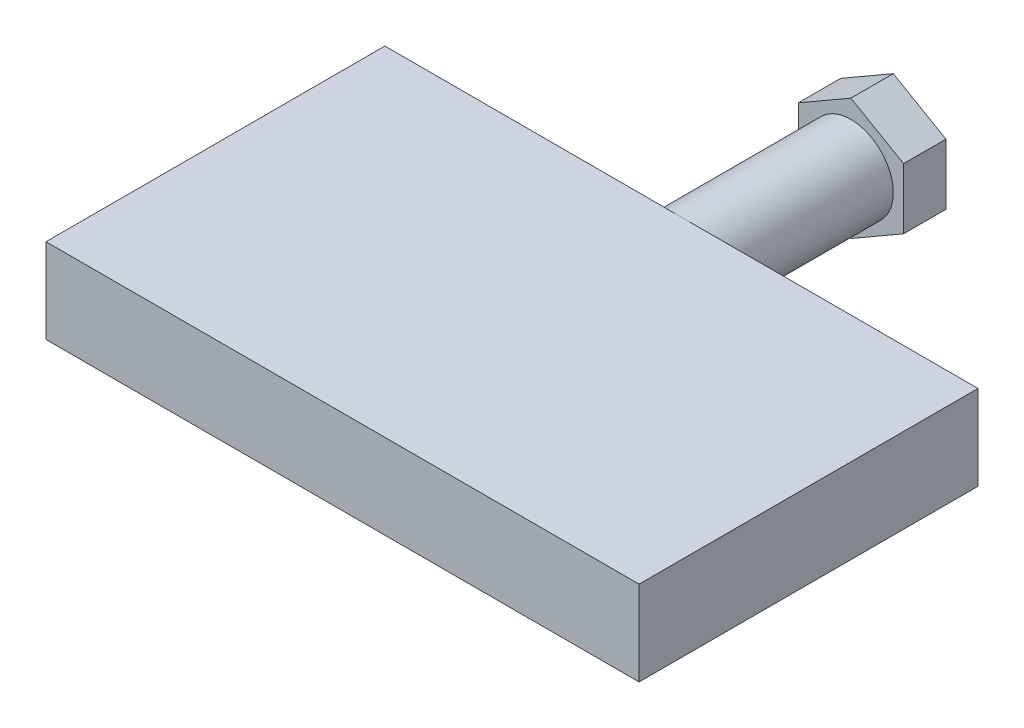
ISO-10303-21;
HEADER;
FILE_DESCRIPTION(('STEP AP214'),'2;1');
FILE_NAME('part.step','',(''),(''),'','','');
FILE_SCHEMA(('AUTOMOTIVE_DESIGN { 1 0 10303 214 1 1 1 1 }'));
ENDSEC;
DATA;
#1=APPLICATION_CONTEXT('core data for automotive mechanical design processes');
#2=APPLICATION_PROTOCOL_DEFINITION('international standard','automotive_design',2000,#1);
#3=PRODUCT_CONTEXT('',#1,'mechanical');
#4=PRODUCT('Part','Part','',(#3));
#5=PRODUCT_RELATED_PRODUCT_CATEGORY('part','',(#4));
#6=PRODUCT_DEFINITION_FORMATION('','',#4);
#7=PRODUCT_DEFINITION_CONTEXT('part definition',#1,'design');
#8=PRODUCT_DEFINITION('design','',#6,#7);
#9=PRODUCT_DEFINITION_SHAPE('','',#8);
#10=(LENGTH_UNIT() NAMED_UNIT(*) SI_UNIT(.MILLI.,.METRE.));
#11=(NAMED_UNIT(*) PLANE_ANGLE_UNIT() SI_UNIT($,.RADIAN.));
#12=(NAMED_UNIT(*) SI_UNIT($,.STERADIAN.) SOLID_ANGLE_UNIT());
#13=UNCERTAINTY_MEASURE_WITH_UNIT(LENGTH_MEASURE(1.E-05),#10,'distance_accuracy_value','');
#14=(GEOMETRIC_REPRESENTATION_CONTEXT(3) GLOBAL_UNCERTAINTY_ASSIGNED_CONTEXT((#13)) GLOBAL_UNIT_ASSIGNED_CONTEXT((#10,
#11,#12)) REPRESENTATION_CONTEXT('',''));
#15=CARTESIAN_POINT('',(0.,0.,0.));
#16=DIRECTION('',(0.,0.,1.));
#17=DIRECTION('',(1.,0.,0.));
#18=AXIS2_PLACEMENT_3D('',#15,#16,#17);
#19=CARTESIAN_POINT('',(0.,10.,-40.657635654133));
#20=DIRECTION('',(0.,0.,-1.));
#21=DIRECTION('',(-1.,0.,0.));
#22=AXIS2_PLACEMENT_3D('',#19,#20,#21);
#23=PLANE('',#22);
#24=CARTESIAN_POINT('',(0.,5.,-40.657635654133));
#25=DIRECTION('',(0.,0.,-1.));
#26=DIRECTION('',(-1.,0.,0.));
#27=AXIS2_PLACEMENT_3D('',#24,#25,#26);
#28=CIRCLE('',#27,5.);
#29=CARTESIAN_POINT('',(0.,10.,-40.657635654133));
#30=VERTEX_POINT('',#29);
#31=CARTESIAN_POINT('',(0.,0.,-40.657635654133));
#32=VERTEX_POINT('',#31);
#33=EDGE_CURVE('E50',#30,#32,#28,.T.);
#34=ORIENTED_EDGE('',*,*,#33,.F.);
#35=DIRECTION('',(1.,0.,0.));
#36=VECTOR('',#35,1.);
#37=CARTESIAN_POINT('',(0.,10.,-40.657635654133));
#38=LINE('',#37,#36);
#39=CARTESIAN_POINT('',(35.,10.,-40.657635654133));
#40=VERTEX_POINT('',#39);
#41=EDGE_CURVE('E64',#30,#40,#38,.T.);
#42=ORIENTED_EDGE('',*,*,#41,.T.);
#43=DIRECTION('',(0.,-1.,0.));
#44=VECTOR('',#43,1.);
#45=CARTESIAN_POINT('',(35.,10.,-40.657635654133));
#46=LINE('',#45,#44);
#47=CARTESIAN_POINT('',(35.,0.,-40.657635654133));
#48=VERTEX_POINT('',#47);
#49=EDGE_CURVE('E186',#40,#48,#46,.T.);
#50=ORIENTED_EDGE('',*,*,#49,.T.);
#51=DIRECTION('',(1.,0.,0.));
#52=VECTOR('',#51,1.);
#53=CARTESIAN_POINT('',(0.,0.,-40.657635654133));
#54=LINE('',#53,#52);
#55=EDGE_CURVE('E86',#32,#48,#54,.T.);
#56=ORIENTED_EDGE('',*,*,#55,.F.);
#57=EDGE_LOOP('',(#34,#42,#50,#56));
#58=FACE_BOUND('',#57,.T.);
#59=ADVANCED_FACE('F39',(#58),#23,.T.);
#60=EDGE_CURVE('E11',#32,#30,#28,.T.);
#61=ORIENTED_EDGE('',*,*,#60,.F.);
#62=CARTESIAN_POINT('',(-35.,0.,-40.657635654133));
#63=VERTEX_POINT('',#62);
#64=EDGE_CURVE('E187',#63,#32,#54,.T.);
#65=ORIENTED_EDGE('',*,*,#64,.F.);
#66=DIRECTION('',(0.,-1.,0.));
#67=VECTOR('',#66,1.);
#68=CARTESIAN_POINT('',(-35.,10.,-40.657635654133));
#69=LINE('',#68,#67);
#70=CARTESIAN_POINT('',(-35.,10.,-40.657635654133));
#71=VERTEX_POINT('',#70);
#72=EDGE_CURVE('E43',#71,#63,#69,.T.);
#73=ORIENTED_EDGE('',*,*,#72,.F.);
#74=EDGE_CURVE('E171',#71,#30,#38,.T.);
#75=ORIENTED_EDGE('',*,*,#74,.T.);
#76=EDGE_LOOP('',(#61,#65,#73,#75));
#77=FACE_BOUND('',#76,.T.);
#78=ADVANCED_FACE('F41',(#77),#23,.T.);
#79=CARTESIAN_POINT('',(-35.,10.,0.));
#80=DIRECTION('',(-1.,0.,0.));
#81=DIRECTION('',(0.,0.,1.));
#82=AXIS2_PLACEMENT_3D('',#79,#80,#81);
#83=PLANE('',#82);
#84=DIRECTION('',(0.,0.,-1.));
#85=VECTOR('',#84,1.);
#86=CARTESIAN_POINT('',(-35.,0.,0.));
#87=LINE('',#86,#85);
#88=CARTESIAN_POINT('',(-35.,0.,-0.657635654132944));
#89=VERTEX_POINT('',#88);
#90=EDGE_CURVE('E190',#89,#63,#87,.T.);
#91=ORIENTED_EDGE('',*,*,#90,.F.);
#92=DIRECTION('',(0.,-1.,0.));
#93=VECTOR('',#92,1.);
#94=CARTESIAN_POINT('',(-35.,10.,-0.657635654132944));
#95=LINE('',#94,#93);
#96=CARTESIAN_POINT('',(-35.,10.,-0.657635654132944));
#97=VERTEX_POINT('',#96);
#98=EDGE_CURVE('E205',#97,#89,#95,.T.);
#99=ORIENTED_EDGE('',*,*,#98,.F.);
#100=DIRECTION('',(0.,0.,-1.));
#101=VECTOR('',#100,1.);
#102=CARTESIAN_POINT('',(-35.,10.,0.));
#103=LINE('',#102,#101);
#104=EDGE_CURVE('E174',#97,#71,#103,.T.);
#105=ORIENTED_EDGE('',*,*,#104,.T.);
#106=ORIENTED_EDGE('',*,*,#72,.T.);
#107=EDGE_LOOP('',(#91,#99,#105,#106));
#108=FACE_BOUND('',#107,.T.);
#109=ADVANCED_FACE('F212',(#108),#83,.T.);
#110=CARTESIAN_POINT('',(0.,10.,-0.657635654132948));
#111=DIRECTION('',(0.,0.,1.));
#112=DIRECTION('',(1.,0.,0.));
#113=AXIS2_PLACEMENT_3D('',#110,#111,#112);
#114=PLANE('',#113);
#115=DIRECTION('',(-1.,0.,0.));
#116=VECTOR('',#115,1.);
#117=CARTESIAN_POINT('',(0.,0.,-0.657635654132948));
#118=LINE('',#117,#116);
#119=CARTESIAN_POINT('',(35.,0.,-0.657635654132953));
#120=VERTEX_POINT('',#119);
#121=EDGE_CURVE('E194',#120,#89,#118,.T.);
#122=ORIENTED_EDGE('',*,*,#121,.F.);
#123=DIRECTION('',(0.,-1.,0.));
#124=VECTOR('',#123,1.);
#125=CARTESIAN_POINT('',(35.,10.,-0.657635654132953));
#126=LINE('',#125,#124);
#127=CARTESIAN_POINT('',(35.,10.,-0.657635654132953));
#128=VERTEX_POINT('',#127);
#129=EDGE_CURVE('E203',#128,#120,#126,.T.);
#130=ORIENTED_EDGE('',*,*,#129,.F.);
#131=DIRECTION('',(-1.,0.,0.));
#132=VECTOR('',#131,1.);
#133=CARTESIAN_POINT('',(0.,10.,-0.657635654132948));
#134=LINE('',#133,#132);
#135=EDGE_CURVE('E178',#128,#97,#134,.T.);
#136=ORIENTED_EDGE('',*,*,#135,.T.);
#137=ORIENTED_EDGE('',*,*,#98,.T.);
#138=EDGE_LOOP('',(#122,#130,#136,#137));
#139=FACE_BOUND('',#138,.T.);
#140=ADVANCED_FACE('F216',(#139),#114,.T.);
#141=CARTESIAN_POINT('',(35.,10.,0.));
#142=DIRECTION('',(1.,0.,0.));
#143=DIRECTION('',(0.,0.,-1.));
#144=AXIS2_PLACEMENT_3D('',#141,#142,#143);
#145=PLANE('',#144);
#146=DIRECTION('',(0.,0.,1.));
#147=VECTOR('',#146,1.);
#148=CARTESIAN_POINT('',(35.,0.,0.));
#149=LINE('',#148,#147);
#150=EDGE_CURVE('E198',#48,#120,#149,.T.);
#151=ORIENTED_EDGE('',*,*,#150,.F.);
#152=ORIENTED_EDGE('',*,*,#49,.F.);
#153=DIRECTION('',(0.,0.,1.));
#154=VECTOR('',#153,1.);
#155=CARTESIAN_POINT('',(35.,10.,0.));
#156=LINE('',#155,#154);
#157=EDGE_CURVE('E182',#40,#128,#156,.T.);
#158=ORIENTED_EDGE('',*,*,#157,.T.);
#159=ORIENTED_EDGE('',*,*,#129,.T.);
#160=EDGE_LOOP('',(#151,#152,#158,#159));
#161=FACE_BOUND('',#160,.T.);
#162=ADVANCED_FACE('F222',(#161),#145,.T.);
#163=CARTESIAN_POINT('',(0.,10.,0.));
#164=DIRECTION('',(0.,1.,0.));
#165=DIRECTION('',(0.,0.,1.));
#166=AXIS2_PLACEMENT_3D('',#163,#164,#165);
#167=PLANE('',#166);
#168=ORIENTED_EDGE('',*,*,#74,.F.);
#169=ORIENTED_EDGE('',*,*,#104,.F.);
#170=ORIENTED_EDGE('',*,*,#135,.F.);
#171=ORIENTED_EDGE('',*,*,#157,.F.);
#172=ORIENTED_EDGE('',*,*,#41,.F.);
#173=EDGE_LOOP('',(#168,#169,#170,#171,#172));
#174=FACE_BOUND('',#173,.T.);
#175=ADVANCED_FACE('F221',(#174),#167,.T.);
#176=CARTESIAN_POINT('',(0.,0.,0.));
#177=DIRECTION('',(0.,1.,0.));
#178=DIRECTION('',(0.,0.,1.));
#179=AXIS2_PLACEMENT_3D('',#176,#177,#178);
#180=PLANE('',#179);
#181=ORIENTED_EDGE('',*,*,#64,.T.);
#182=ORIENTED_EDGE('',*,*,#55,.T.);
#183=ORIENTED_EDGE('',*,*,#150,.T.);
#184=ORIENTED_EDGE('',*,*,#121,.T.);
#185=ORIENTED_EDGE('',*,*,#90,.T.);
#186=EDGE_LOOP('',(#181,#182,#183,#184,#185));
#187=FACE_BOUND('',#186,.T.);
#188=ADVANCED_FACE('F214',(#187),#180,.F.);
#189=CARTESIAN_POINT('',(0.,5.,-60.657635654133));
#190=DIRECTION('',(0.,0.,1.));
#191=DIRECTION('',(1.,0.,0.));
#192=AXIS2_PLACEMENT_3D('',#189,#190,#191);
#193=CYLINDRICAL_SURFACE('',#192,5.);
#194=CARTESIAN_POINT('',(0.,5.,-60.657635654133));
#195=DIRECTION('',(0.,0.,-1.));
#196=DIRECTION('',(-1.,0.,0.));
#197=AXIS2_PLACEMENT_3D('',#194,#195,#196);
#198=CIRCLE('',#197,5.);
#199=CARTESIAN_POINT('',(-5.,5.,-60.657635654133));
#200=VERTEX_POINT('',#199);
#201=EDGE_CURVE('E163',#200,#200,#198,.T.);
#202=ORIENTED_EDGE('',*,*,#201,.F.);
#203=EDGE_LOOP('',(#202));
#204=FACE_BOUND('',#203,.T.);
#205=ORIENTED_EDGE('',*,*,#33,.T.);
#206=ORIENTED_EDGE('',*,*,#60,.T.);
#207=EDGE_LOOP('',(#205,#206));
#208=FACE_BOUND('',#207,.T.);
#209=ADVANCED_FACE('F226',(#204,#208),#193,.T.);
#210=CARTESIAN_POINT('',(6.21470170513772,1.41194029760541,-65.657635654133));
#211=DIRECTION('',(-0.499999999999995,0.866025403784442,0.));
#212=DIRECTION('',(-0.866025403784442,-0.499999999999995,0.));
#213=AXIS2_PLACEMENT_3D('',#210,#211,#212);
#214=PLANE('',#213);
#215=DIRECTION('',(-0.866025403784442,-0.499999999999995,0.));
#216=VECTOR('',#215,1.);
#217=CARTESIAN_POINT('',(6.21470170513772,1.41194029760541,-60.657635654133));
#218=LINE('',#217,#216);
#219=CARTESIAN_POINT('',(6.21470170513772,1.41194029760541,-60.657635654133));
#220=VERTEX_POINT('',#219);
#221=CARTESIAN_POINT('',(0.,-2.17611940478903,-60.657635654133));
#222=VERTEX_POINT('',#221);
#223=EDGE_CURVE('E157',#220,#222,#218,.T.);
#224=ORIENTED_EDGE('',*,*,#223,.T.);
#225=DIRECTION('',(0.,0.,1.));
#226=VECTOR('',#225,1.);
#227=CARTESIAN_POINT('',(0.,-2.17611940478903,-65.657635654133));
#228=LINE('',#227,#226);
#229=CARTESIAN_POINT('',(0.,-2.17611940478903,-65.657635654133));
#230=VERTEX_POINT('',#229);
#231=EDGE_CURVE('E135',#230,#222,#228,.T.);
#232=ORIENTED_EDGE('',*,*,#231,.F.);
#233=DIRECTION('',(-0.866025403784442,-0.499999999999995,0.));
#234=VECTOR('',#233,1.);
#235=CARTESIAN_POINT('',(6.21470170513772,1.41194029760541,-65.657635654133));
#236=LINE('',#235,#234);
#237=CARTESIAN_POINT('',(6.21470170513772,1.41194029760541,-65.657635654133));
#238=VERTEX_POINT('',#237);
#239=EDGE_CURVE('E143',#238,#230,#236,.T.);
#240=ORIENTED_EDGE('',*,*,#239,.F.);
#241=DIRECTION('',(0.,0.,1.));
#242=VECTOR('',#241,1.);
#243=CARTESIAN_POINT('',(6.21470170513772,1.41194029760541,-65.657635654133));
#244=LINE('',#243,#242);
#245=EDGE_CURVE('E365',#238,#220,#244,.T.);
#246=ORIENTED_EDGE('',*,*,#245,.T.);
#247=EDGE_LOOP('',(#224,#232,#240,#246));
#248=FACE_BOUND('',#247,.T.);
#249=ADVANCED_FACE('F155',(#248),#214,.F.);
#250=CARTESIAN_POINT('',(0.,-2.17611940478903,-65.657635654133));
#251=DIRECTION('',(0.500000000000001,0.866025403784438,0.));
#252=DIRECTION('',(-0.866025403784438,0.500000000000001,0.));
#253=AXIS2_PLACEMENT_3D('',#250,#251,#252);
#254=PLANE('',#253);
#255=DIRECTION('',(-0.866025403784438,0.500000000000001,0.));
#256=VECTOR('',#255,1.);
#257=CARTESIAN_POINT('',(0.,-2.17611940478903,-60.657635654133));
#258=LINE('',#257,#256);
#259=CARTESIAN_POINT('',(-6.21470170513777,1.4119402976055,-60.657635654133));
#260=VERTEX_POINT('',#259);
#261=EDGE_CURVE('E346',#222,#260,#258,.T.);
#262=ORIENTED_EDGE('',*,*,#261,.T.);
#263=DIRECTION('',(0.,0.,1.));
#264=VECTOR('',#263,1.);
#265=CARTESIAN_POINT('',(-6.21470170513777,1.4119402976055,-65.657635654133));
#266=LINE('',#265,#264);
#267=CARTESIAN_POINT('',(-6.21470170513777,1.4119402976055,-65.657635654133));
#268=VERTEX_POINT('',#267);
#269=EDGE_CURVE('E138',#268,#260,#266,.T.);
#270=ORIENTED_EDGE('',*,*,#269,.F.);
#271=DIRECTION('',(-0.866025403784438,0.500000000000001,0.));
#272=VECTOR('',#271,1.);
#273=CARTESIAN_POINT('',(0.,-2.17611940478903,-65.657635654133));
#274=LINE('',#273,#272);
#275=EDGE_CURVE('E131',#230,#268,#274,.T.);
#276=ORIENTED_EDGE('',*,*,#275,.F.);
#277=ORIENTED_EDGE('',*,*,#231,.T.);
#278=EDGE_LOOP('',(#262,#270,#276,#277));
#279=FACE_BOUND('',#278,.T.);
#280=ADVANCED_FACE('F133',(#279),#254,.F.);
#281=CARTESIAN_POINT('',(-6.21470170513777,1.4119402976055,-65.657635654133));
#282=DIRECTION('',(1.,0.,0.));
#283=DIRECTION('',(0.,1.,0.));
#284=AXIS2_PLACEMENT_3D('',#281,#282,#283);
#285=PLANE('',#284);
#286=DIRECTION('',(0.,1.,0.));
#287=VECTOR('',#286,1.);
#288=CARTESIAN_POINT('',(-6.21470170513777,1.4119402976055,-60.657635654133));
#289=LINE('',#288,#287);
#290=CARTESIAN_POINT('',(-6.21470170513775,8.58805970239454,-60.657635654133));
#291=VERTEX_POINT('',#290);
#292=EDGE_CURVE('E350',#260,#291,#289,.T.);
#293=ORIENTED_EDGE('',*,*,#292,.T.);
#294=DIRECTION('',(0.,0.,1.));
#295=VECTOR('',#294,1.);
#296=CARTESIAN_POINT('',(-6.21470170513775,8.58805970239454,-65.657635654133));
#297=LINE('',#296,#295);
#298=CARTESIAN_POINT('',(-6.21470170513775,8.58805970239454,-65.657635654133));
#299=VERTEX_POINT('',#298);
#300=EDGE_CURVE('E164',#299,#291,#297,.T.);
#301=ORIENTED_EDGE('',*,*,#300,.F.);
#302=DIRECTION('',(0.,1.,0.));
#303=VECTOR('',#302,1.);
#304=CARTESIAN_POINT('',(-6.21470170513777,1.4119402976055,-65.657635654133));
#305=LINE('',#304,#303);
#306=EDGE_CURVE('E142',#268,#299,#305,.T.);
#307=ORIENTED_EDGE('',*,*,#306,.F.);
#308=ORIENTED_EDGE('',*,*,#269,.T.);
#309=EDGE_LOOP('',(#293,#301,#307,#308));
#310=FACE_BOUND('',#309,.T.);
#311=ADVANCED_FACE('F281',(#310),#285,.F.);
#312=CARTESIAN_POINT('',(-6.21470170513775,8.58805970239454,-65.657635654133));
#313=DIRECTION('',(0.499999999999995,-0.866025403784442,0.));
#314=DIRECTION('',(0.866025403784442,0.499999999999995,0.));
#315=AXIS2_PLACEMENT_3D('',#312,#313,#314);
#316=PLANE('',#315);
#317=DIRECTION('',(0.866025403784442,0.499999999999995,0.));
#318=VECTOR('',#317,1.);
#319=CARTESIAN_POINT('',(-6.21470170513775,8.58805970239454,-60.657635654133));
#320=LINE('',#319,#318);
#321=CARTESIAN_POINT('',(0.,12.176119404789,-60.657635654133));
#322=VERTEX_POINT('',#321);
#323=EDGE_CURVE('E357',#291,#322,#320,.T.);
#324=ORIENTED_EDGE('',*,*,#323,.T.);
#325=DIRECTION('',(0.,0.,1.));
#326=VECTOR('',#325,1.);
#327=CARTESIAN_POINT('',(0.,12.176119404789,-65.657635654133));
#328=LINE('',#327,#326);
#329=CARTESIAN_POINT('',(0.,12.176119404789,-65.657635654133));
#330=VERTEX_POINT('',#329);
#331=EDGE_CURVE('E372',#330,#322,#328,.T.);
#332=ORIENTED_EDGE('',*,*,#331,.F.);
#333=DIRECTION('',(0.866025403784442,0.499999999999995,0.));
#334=VECTOR('',#333,1.);
#335=CARTESIAN_POINT('',(-6.21470170513775,8.58805970239454,-65.657635654133));
#336=LINE('',#335,#334);
#337=EDGE_CURVE('E381',#299,#330,#336,.T.);
#338=ORIENTED_EDGE('',*,*,#337,.F.);
#339=ORIENTED_EDGE('',*,*,#300,.T.);
#340=EDGE_LOOP('',(#324,#332,#338,#339));
#341=FACE_BOUND('',#340,.T.);
#342=ADVANCED_FACE('F290',(#341),#316,.F.);
#343=CARTESIAN_POINT('',(0.,12.176119404789,-65.657635654133));
#344=DIRECTION('',(-0.500000000000007,-0.866025403784435,0.));
#345=DIRECTION('',(0.866025403784435,-0.500000000000007,0.));
#346=AXIS2_PLACEMENT_3D('',#343,#344,#345);
#347=PLANE('',#346);
#348=DIRECTION('',(0.866025403784435,-0.500000000000007,0.));
#349=VECTOR('',#348,1.);
#350=CARTESIAN_POINT('',(0.,12.176119404789,-60.657635654133));
#351=LINE('',#350,#349);
#352=CARTESIAN_POINT('',(6.2147017051378,8.58805970239446,-60.657635654133));
#353=VERTEX_POINT('',#352);
#354=EDGE_CURVE('E360',#322,#353,#351,.T.);
#355=ORIENTED_EDGE('',*,*,#354,.T.);
#356=DIRECTION('',(0.,0.,1.));
#357=VECTOR('',#356,1.);
#358=CARTESIAN_POINT('',(6.2147017051378,8.58805970239446,-65.657635654133));
#359=LINE('',#358,#357);
#360=CARTESIAN_POINT('',(6.2147017051378,8.58805970239446,-65.657635654133));
#361=VERTEX_POINT('',#360);
#362=EDGE_CURVE('E368',#361,#353,#359,.T.);
#363=ORIENTED_EDGE('',*,*,#362,.F.);
#364=DIRECTION('',(0.866025403784435,-0.500000000000007,0.));
#365=VECTOR('',#364,1.);
#366=CARTESIAN_POINT('',(0.,12.176119404789,-65.657635654133));
#367=LINE('',#366,#365);
#368=EDGE_CURVE('E385',#330,#361,#367,.T.);
#369=ORIENTED_EDGE('',*,*,#368,.F.);
#370=ORIENTED_EDGE('',*,*,#331,.T.);
#371=EDGE_LOOP('',(#355,#363,#369,#370));
#372=FACE_BOUND('',#371,.T.);
#373=ADVANCED_FACE('F300',(#372),#347,.F.);
#374=CARTESIAN_POINT('',(6.2147017051378,8.58805970239446,-65.657635654133));
#375=DIRECTION('',(-1.,0.,0.));
#376=DIRECTION('',(0.,-1.,0.));
#377=AXIS2_PLACEMENT_3D('',#374,#375,#376);
#378=PLANE('',#377);
#379=DIRECTION('',(0.,-1.,0.));
#380=VECTOR('',#379,1.);
#381=CARTESIAN_POINT('',(6.2147017051378,8.58805970239446,-60.657635654133));
#382=LINE('',#381,#380);
#383=EDGE_CURVE('E153',#353,#220,#382,.T.);
#384=ORIENTED_EDGE('',*,*,#383,.T.);
#385=ORIENTED_EDGE('',*,*,#245,.F.);
#386=DIRECTION('',(0.,-1.,0.));
#387=VECTOR('',#386,1.);
#388=CARTESIAN_POINT('',(6.2147017051378,8.58805970239446,-65.657635654133));
#389=LINE('',#388,#387);
#390=EDGE_CURVE('E148',#361,#238,#389,.T.);
#391=ORIENTED_EDGE('',*,*,#390,.F.);
#392=ORIENTED_EDGE('',*,*,#362,.T.);
#393=EDGE_LOOP('',(#384,#385,#391,#392));
#394=FACE_BOUND('',#393,.T.);
#395=ADVANCED_FACE('F310',(#394),#378,.F.);
#396=CARTESIAN_POINT('',(0.,0.,-65.657635654133));
#397=DIRECTION('',(0.,0.,-1.));
#398=DIRECTION('',(-1.,0.,0.));
#399=AXIS2_PLACEMENT_3D('',#396,#397,#398);
#400=PLANE('',#399);
#401=ORIENTED_EDGE('',*,*,#239,.T.);
#402=ORIENTED_EDGE('',*,*,#275,.T.);
#403=ORIENTED_EDGE('',*,*,#306,.T.);
#404=ORIENTED_EDGE('',*,*,#337,.T.);
#405=ORIENTED_EDGE('',*,*,#368,.T.);
#406=ORIENTED_EDGE('',*,*,#390,.T.);
#407=EDGE_LOOP('',(#401,#402,#403,#404,#405,#406));
#408=FACE_BOUND('',#407,.T.);
#409=ADVANCED_FACE('F146',(#408),#400,.T.);
#410=CARTESIAN_POINT('',(0.,0.,-60.657635654133));
#411=DIRECTION('',(0.,0.,-1.));
#412=DIRECTION('',(-1.,0.,0.));
#413=AXIS2_PLACEMENT_3D('',#410,#411,#412);
#414=PLANE('',#413);
#415=ORIENTED_EDGE('',*,*,#201,.T.);
#416=EDGE_LOOP('',(#415));
#417=FACE_BOUND('',#416,.T.);
#418=ORIENTED_EDGE('',*,*,#223,.F.);
#419=ORIENTED_EDGE('',*,*,#383,.F.);
#420=ORIENTED_EDGE('',*,*,#354,.F.);
#421=ORIENTED_EDGE('',*,*,#323,.F.);
#422=ORIENTED_EDGE('',*,*,#292,.F.);
#423=ORIENTED_EDGE('',*,*,#261,.F.);
#424=EDGE_LOOP('',(#418,#419,#420,#421,#422,#423));
#425=FACE_BOUND('',#424,.T.);
#426=ADVANCED_FACE('F329',(#417,#425),#414,.F.);
#427=CLOSED_SHELL('',(#59,#78,#109,#140,#162,#175,#188,#209,#249,#280,#311,#342,#373,#395,#409,#426));
#428=MANIFOLD_SOLID_BREP('B2',#427);
#429=ADVANCED_BREP_SHAPE_REPRESENTATION('',(#18,#428),#14);
#430=SHAPE_DEFINITION_REPRESENTATION(#9,#429);
ENDSEC;
END-ISO-10303-21;
